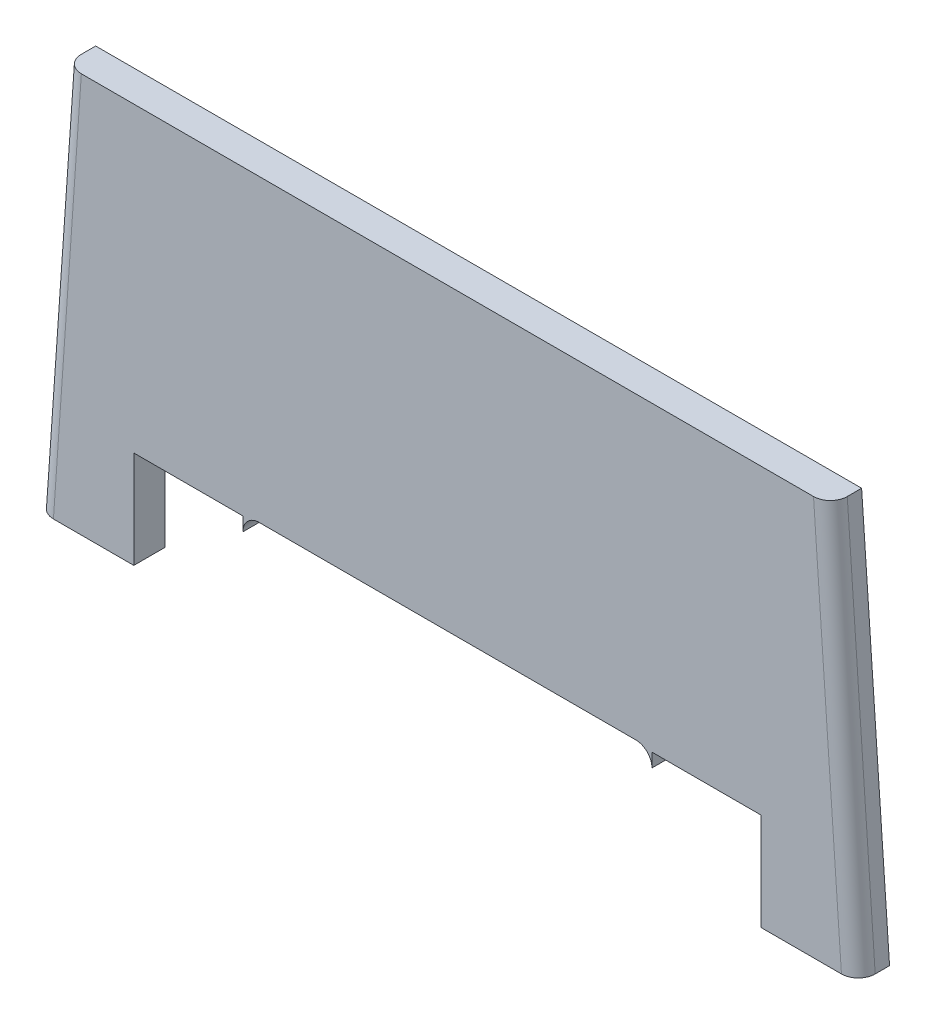
ISO-10303-21;
HEADER;
FILE_DESCRIPTION(('STEP AP214'),'2;1');
FILE_NAME('part.step','',(''),(''),'','','');
FILE_SCHEMA(('AUTOMOTIVE_DESIGN { 1 0 10303 214 1 1 1 1 }'));
ENDSEC;
DATA;
#1=APPLICATION_CONTEXT('core data for automotive mechanical design processes');
#2=APPLICATION_PROTOCOL_DEFINITION('international standard','automotive_design',2000,#1);
#3=PRODUCT_CONTEXT('',#1,'mechanical');
#4=PRODUCT('Part','Part','',(#3));
#5=PRODUCT_RELATED_PRODUCT_CATEGORY('part','',(#4));
#6=PRODUCT_DEFINITION_FORMATION('','',#4);
#7=PRODUCT_DEFINITION_CONTEXT('part definition',#1,'design');
#8=PRODUCT_DEFINITION('design','',#6,#7);
#9=PRODUCT_DEFINITION_SHAPE('','',#8);
#10=(LENGTH_UNIT() NAMED_UNIT(*) SI_UNIT(.MILLI.,.METRE.));
#11=(NAMED_UNIT(*) PLANE_ANGLE_UNIT() SI_UNIT($,.RADIAN.));
#12=(NAMED_UNIT(*) SI_UNIT($,.STERADIAN.) SOLID_ANGLE_UNIT());
#13=UNCERTAINTY_MEASURE_WITH_UNIT(LENGTH_MEASURE(1.E-05),#10,'distance_accuracy_value','');
#14=(GEOMETRIC_REPRESENTATION_CONTEXT(3) GLOBAL_UNCERTAINTY_ASSIGNED_CONTEXT((#13)) GLOBAL_UNIT_ASSIGNED_CONTEXT((#10,
#11,#12)) REPRESENTATION_CONTEXT('',''));
#15=CARTESIAN_POINT('',(0.,0.,0.));
#16=DIRECTION('',(0.,0.,1.));
#17=DIRECTION('',(1.,0.,0.));
#18=AXIS2_PLACEMENT_3D('',#15,#16,#17);
#19=CARTESIAN_POINT('',(-251.2,-80.,25.));
#20=DIRECTION('',(0.,-1.,0.));
#21=DIRECTION('',(1.,0.,0.));
#22=AXIS2_PLACEMENT_3D('',#19,#20,#21);
#23=PLANE('',#22);
#24=DIRECTION('',(-1.,0.,0.));
#25=VECTOR('',#24,1.);
#26=CARTESIAN_POINT('',(-251.2,-80.,25.));
#27=LINE('',#26,#25);
#28=CARTESIAN_POINT('',(-251.2,-80.,25.));
#29=VERTEX_POINT('',#28);
#30=CARTESIAN_POINT('',(-315.567034375904,-80.,25.));
#31=VERTEX_POINT('',#30);
#32=EDGE_CURVE('E180',#29,#31,#27,.T.);
#33=ORIENTED_EDGE('',*,*,#32,.T.);
#34=CARTESIAN_POINT('',(-315.567034375904,-80.,11.5));
#35=DIRECTION('',(0.,-1.,0.));
#36=DIRECTION('',(1.,0.,0.));
#37=AXIS2_PLACEMENT_3D('',#34,#35,#36);
#38=ELLIPSE('',#37,13.5329656240958,13.5);
#39=CARTESIAN_POINT('',(-329.1,-80.,11.5));
#40=VERTEX_POINT('',#39);
#41=EDGE_CURVE('E11',#31,#40,#38,.T.);
#42=ORIENTED_EDGE('',*,*,#41,.T.);
#43=DIRECTION('',(0.,0.,-1.));
#44=VECTOR('',#43,1.);
#45=CARTESIAN_POINT('',(-329.1,-80.,25.));
#46=LINE('',#45,#44);
#47=CARTESIAN_POINT('',(-329.1,-80.,0.));
#48=VERTEX_POINT('',#47);
#49=EDGE_CURVE('E203',#40,#48,#46,.T.);
#50=ORIENTED_EDGE('',*,*,#49,.T.);
#51=DIRECTION('',(-1.,0.,0.));
#52=VECTOR('',#51,1.);
#53=CARTESIAN_POINT('',(-251.2,-80.,0.));
#54=LINE('',#53,#52);
#55=CARTESIAN_POINT('',(-251.2,-80.,0.));
#56=VERTEX_POINT('',#55);
#57=EDGE_CURVE('E204',#56,#48,#54,.T.);
#58=ORIENTED_EDGE('',*,*,#57,.F.);
#59=DIRECTION('',(0.,0.,-1.));
#60=VECTOR('',#59,1.);
#61=CARTESIAN_POINT('',(-251.2,-80.,25.));
#62=LINE('',#61,#60);
#63=EDGE_CURVE('E240',#29,#56,#62,.T.);
#64=ORIENTED_EDGE('',*,*,#63,.F.);
#65=EDGE_LOOP('',(#33,#42,#50,#58,#64));
#66=FACE_BOUND('',#65,.T.);
#67=ADVANCED_FACE('F36',(#66),#23,.T.);
#68=CARTESIAN_POINT('',(-251.2,-2.,25.));
#69=DIRECTION('',(1.,0.,0.));
#70=DIRECTION('',(0.,0.,-1.));
#71=AXIS2_PLACEMENT_3D('',#68,#69,#70);
#72=PLANE('',#71);
#73=DIRECTION('',(0.,-1.,0.));
#74=VECTOR('',#73,1.);
#75=CARTESIAN_POINT('',(-251.2,-2.,0.));
#76=LINE('',#75,#74);
#77=CARTESIAN_POINT('',(-251.2,-2.,0.));
#78=VERTEX_POINT('',#77);
#79=EDGE_CURVE('E237',#78,#56,#76,.T.);
#80=ORIENTED_EDGE('',*,*,#79,.F.);
#81=DIRECTION('',(0.,0.,-1.));
#82=VECTOR('',#81,1.);
#83=CARTESIAN_POINT('',(-251.2,-2.,25.));
#84=LINE('',#83,#82);
#85=CARTESIAN_POINT('',(-251.2,-2.,25.));
#86=VERTEX_POINT('',#85);
#87=EDGE_CURVE('E243',#86,#78,#84,.T.);
#88=ORIENTED_EDGE('',*,*,#87,.F.);
#89=DIRECTION('',(0.,-1.,0.));
#90=VECTOR('',#89,1.);
#91=CARTESIAN_POINT('',(-251.2,-2.,25.));
#92=LINE('',#91,#90);
#93=EDGE_CURVE('E200',#86,#29,#92,.T.);
#94=ORIENTED_EDGE('',*,*,#93,.T.);
#95=ORIENTED_EDGE('',*,*,#63,.T.);
#96=EDGE_LOOP('',(#80,#88,#94,#95));
#97=FACE_BOUND('',#96,.T.);
#98=ADVANCED_FACE('F295',(#97),#72,.T.);
#99=CARTESIAN_POINT('',(-163.8,-1.99999999999999,25.));
#100=DIRECTION('',(0.,-1.,0.));
#101=DIRECTION('',(1.,0.,0.));
#102=AXIS2_PLACEMENT_3D('',#99,#100,#101);
#103=PLANE('',#102);
#104=DIRECTION('',(-1.,0.,0.));
#105=VECTOR('',#104,1.);
#106=CARTESIAN_POINT('',(-163.8,-1.99999999999999,0.));
#107=LINE('',#106,#105);
#108=CARTESIAN_POINT('',(-163.8,-1.99999999999999,0.));
#109=VERTEX_POINT('',#108);
#110=EDGE_CURVE('E234',#109,#78,#107,.T.);
#111=ORIENTED_EDGE('',*,*,#110,.F.);
#112=DIRECTION('',(0.,0.,-1.));
#113=VECTOR('',#112,1.);
#114=CARTESIAN_POINT('',(-163.8,-1.99999999999999,25.));
#115=LINE('',#114,#113);
#116=CARTESIAN_POINT('',(-163.8,-1.99999999999999,25.));
#117=VERTEX_POINT('',#116);
#118=EDGE_CURVE('E245',#117,#109,#115,.T.);
#119=ORIENTED_EDGE('',*,*,#118,.F.);
#120=DIRECTION('',(-1.,0.,0.));
#121=VECTOR('',#120,1.);
#122=CARTESIAN_POINT('',(-163.8,-1.99999999999999,25.));
#123=LINE('',#122,#121);
#124=EDGE_CURVE('E197',#117,#86,#123,.T.);
#125=ORIENTED_EDGE('',*,*,#124,.T.);
#126=ORIENTED_EDGE('',*,*,#87,.T.);
#127=EDGE_LOOP('',(#111,#119,#125,#126));
#128=FACE_BOUND('',#127,.T.);
#129=ADVANCED_FACE('F298',(#128),#103,.T.);
#130=CARTESIAN_POINT('',(-163.8,-1.99999999999999,25.));
#131=DIRECTION('',(1.,0.,0.));
#132=DIRECTION('',(0.,1.,0.));
#133=AXIS2_PLACEMENT_3D('',#130,#131,#132);
#134=PLANE('',#133);
#135=DIRECTION('',(0.,-1.,0.));
#136=VECTOR('',#135,1.);
#137=CARTESIAN_POINT('',(-163.8,-1.99999999999999,0.));
#138=LINE('',#137,#136);
#139=CARTESIAN_POINT('',(-163.8,-13.,0.));
#140=VERTEX_POINT('',#139);
#141=EDGE_CURVE('E232',#109,#140,#138,.T.);
#142=ORIENTED_EDGE('',*,*,#141,.T.);
#143=DIRECTION('',(0.,0.,-1.));
#144=VECTOR('',#143,1.);
#145=CARTESIAN_POINT('',(-163.8,-13.,25.));
#146=LINE('',#145,#144);
#147=CARTESIAN_POINT('',(-163.8,-13.,25.));
#148=VERTEX_POINT('',#147);
#149=EDGE_CURVE('E247',#148,#140,#146,.T.);
#150=ORIENTED_EDGE('',*,*,#149,.F.);
#151=DIRECTION('',(0.,-1.,0.));
#152=VECTOR('',#151,1.);
#153=CARTESIAN_POINT('',(-163.8,-1.99999999999999,25.));
#154=LINE('',#153,#152);
#155=EDGE_CURVE('E195',#117,#148,#154,.T.);
#156=ORIENTED_EDGE('',*,*,#155,.F.);
#157=ORIENTED_EDGE('',*,*,#118,.T.);
#158=EDGE_LOOP('',(#142,#150,#156,#157));
#159=FACE_BOUND('',#158,.T.);
#160=ADVANCED_FACE('F304',(#159),#134,.F.);
#161=CARTESIAN_POINT('',(-150.8,-13.,25.));
#162=DIRECTION('',(0.,0.,-1.));
#163=DIRECTION('',(-1.,0.,0.));
#164=AXIS2_PLACEMENT_3D('',#161,#162,#163);
#165=CYLINDRICAL_SURFACE('',#164,13.);
#166=CARTESIAN_POINT('',(-150.8,-13.,0.));
#167=DIRECTION('',(0.,0.,-1.));
#168=DIRECTION('',(-1.,0.,0.));
#169=AXIS2_PLACEMENT_3D('',#166,#167,#168);
#170=CIRCLE('',#169,13.);
#171=CARTESIAN_POINT('',(-150.8,0.,0.));
#172=VERTEX_POINT('',#171);
#173=EDGE_CURVE('E230',#140,#172,#170,.T.);
#174=ORIENTED_EDGE('',*,*,#173,.T.);
#175=DIRECTION('',(0.,0.,-1.));
#176=VECTOR('',#175,1.);
#177=CARTESIAN_POINT('',(-150.8,0.,25.));
#178=LINE('',#177,#176);
#179=CARTESIAN_POINT('',(-150.8,0.,25.));
#180=VERTEX_POINT('',#179);
#181=EDGE_CURVE('E250',#180,#172,#178,.T.);
#182=ORIENTED_EDGE('',*,*,#181,.F.);
#183=CARTESIAN_POINT('',(-150.8,-13.,25.));
#184=DIRECTION('',(0.,0.,-1.));
#185=DIRECTION('',(-1.,0.,0.));
#186=AXIS2_PLACEMENT_3D('',#183,#184,#185);
#187=CIRCLE('',#186,13.);
#188=EDGE_CURVE('E193',#148,#180,#187,.T.);
#189=ORIENTED_EDGE('',*,*,#188,.F.);
#190=ORIENTED_EDGE('',*,*,#149,.T.);
#191=EDGE_LOOP('',(#174,#182,#189,#190));
#192=FACE_BOUND('',#191,.T.);
#193=ADVANCED_FACE('F308',(#192),#165,.F.);
#194=CARTESIAN_POINT('',(-150.8,0.,25.));
#195=DIRECTION('',(0.,1.,0.));
#196=DIRECTION('',(-1.,0.,0.));
#197=AXIS2_PLACEMENT_3D('',#194,#195,#196);
#198=PLANE('',#197);
#199=DIRECTION('',(1.,0.,0.));
#200=VECTOR('',#199,1.);
#201=CARTESIAN_POINT('',(-150.8,0.,0.));
#202=LINE('',#201,#200);
#203=CARTESIAN_POINT('',(150.8,0.,0.));
#204=VERTEX_POINT('',#203);
#205=EDGE_CURVE('E227',#172,#204,#202,.T.);
#206=ORIENTED_EDGE('',*,*,#205,.T.);
#207=DIRECTION('',(0.,0.,-1.));
#208=VECTOR('',#207,1.);
#209=CARTESIAN_POINT('',(150.8,0.,25.));
#210=LINE('',#209,#208);
#211=CARTESIAN_POINT('',(150.8,0.,25.));
#212=VERTEX_POINT('',#211);
#213=EDGE_CURVE('E253',#212,#204,#210,.T.);
#214=ORIENTED_EDGE('',*,*,#213,.F.);
#215=DIRECTION('',(1.,0.,0.));
#216=VECTOR('',#215,1.);
#217=CARTESIAN_POINT('',(-150.8,0.,25.));
#218=LINE('',#217,#216);
#219=EDGE_CURVE('E191',#180,#212,#218,.T.);
#220=ORIENTED_EDGE('',*,*,#219,.F.);
#221=ORIENTED_EDGE('',*,*,#181,.T.);
#222=EDGE_LOOP('',(#206,#214,#220,#221));
#223=FACE_BOUND('',#222,.T.);
#224=ADVANCED_FACE('F313',(#223),#198,.F.);
#225=CARTESIAN_POINT('',(150.8,-13.,25.));
#226=DIRECTION('',(0.,0.,-1.));
#227=DIRECTION('',(-1.,0.,0.));
#228=AXIS2_PLACEMENT_3D('',#225,#226,#227);
#229=CYLINDRICAL_SURFACE('',#228,13.);
#230=CARTESIAN_POINT('',(150.8,-13.,0.));
#231=DIRECTION('',(0.,0.,1.));
#232=DIRECTION('',(1.,0.,0.));
#233=AXIS2_PLACEMENT_3D('',#230,#231,#232);
#234=CIRCLE('',#233,13.);
#235=CARTESIAN_POINT('',(163.8,-13.,0.));
#236=VERTEX_POINT('',#235);
#237=EDGE_CURVE('E224',#236,#204,#234,.T.);
#238=ORIENTED_EDGE('',*,*,#237,.F.);
#239=DIRECTION('',(0.,0.,-1.));
#240=VECTOR('',#239,1.);
#241=CARTESIAN_POINT('',(163.8,-13.,25.));
#242=LINE('',#241,#240);
#243=CARTESIAN_POINT('',(163.8,-13.,25.));
#244=VERTEX_POINT('',#243);
#245=EDGE_CURVE('E255',#244,#236,#242,.T.);
#246=ORIENTED_EDGE('',*,*,#245,.F.);
#247=CARTESIAN_POINT('',(150.8,-13.,25.));
#248=DIRECTION('',(0.,0.,1.));
#249=DIRECTION('',(1.,0.,0.));
#250=AXIS2_PLACEMENT_3D('',#247,#248,#249);
#251=CIRCLE('',#250,13.);
#252=EDGE_CURVE('E188',#244,#212,#251,.T.);
#253=ORIENTED_EDGE('',*,*,#252,.T.);
#254=ORIENTED_EDGE('',*,*,#213,.T.);
#255=EDGE_LOOP('',(#238,#246,#253,#254));
#256=FACE_BOUND('',#255,.T.);
#257=ADVANCED_FACE('F360',(#256),#229,.F.);
#258=CARTESIAN_POINT('',(163.8,-1.99999999999995,25.));
#259=DIRECTION('',(1.,0.,0.));
#260=DIRECTION('',(0.,1.,0.));
#261=AXIS2_PLACEMENT_3D('',#258,#259,#260);
#262=PLANE('',#261);
#263=DIRECTION('',(0.,-1.,0.));
#264=VECTOR('',#263,1.);
#265=CARTESIAN_POINT('',(163.8,-1.99999999999995,0.));
#266=LINE('',#265,#264);
#267=CARTESIAN_POINT('',(163.8,-1.99999999999995,0.));
#268=VERTEX_POINT('',#267);
#269=EDGE_CURVE('E221',#268,#236,#266,.T.);
#270=ORIENTED_EDGE('',*,*,#269,.F.);
#271=DIRECTION('',(0.,0.,-1.));
#272=VECTOR('',#271,1.);
#273=CARTESIAN_POINT('',(163.8,-1.99999999999995,25.));
#274=LINE('',#273,#272);
#275=CARTESIAN_POINT('',(163.8,-1.99999999999995,25.));
#276=VERTEX_POINT('',#275);
#277=EDGE_CURVE('E257',#276,#268,#274,.T.);
#278=ORIENTED_EDGE('',*,*,#277,.F.);
#279=DIRECTION('',(0.,-1.,0.));
#280=VECTOR('',#279,1.);
#281=CARTESIAN_POINT('',(163.8,-1.99999999999995,25.));
#282=LINE('',#281,#280);
#283=EDGE_CURVE('E185',#276,#244,#282,.T.);
#284=ORIENTED_EDGE('',*,*,#283,.T.);
#285=ORIENTED_EDGE('',*,*,#245,.T.);
#286=EDGE_LOOP('',(#270,#278,#284,#285));
#287=FACE_BOUND('',#286,.T.);
#288=ADVANCED_FACE('F318',(#287),#262,.T.);
#289=CARTESIAN_POINT('',(163.8,-1.99999999999995,25.));
#290=DIRECTION('',(0.,1.,0.));
#291=DIRECTION('',(-1.,0.,0.));
#292=AXIS2_PLACEMENT_3D('',#289,#290,#291);
#293=PLANE('',#292);
#294=DIRECTION('',(1.,0.,0.));
#295=VECTOR('',#294,1.);
#296=CARTESIAN_POINT('',(163.8,-1.99999999999995,0.));
#297=LINE('',#296,#295);
#298=CARTESIAN_POINT('',(251.2,-1.99999999999994,0.));
#299=VERTEX_POINT('',#298);
#300=EDGE_CURVE('E219',#268,#299,#297,.T.);
#301=ORIENTED_EDGE('',*,*,#300,.T.);
#302=DIRECTION('',(0.,0.,-1.));
#303=VECTOR('',#302,1.);
#304=CARTESIAN_POINT('',(251.2,-1.99999999999994,25.));
#305=LINE('',#304,#303);
#306=CARTESIAN_POINT('',(251.2,-1.99999999999994,25.));
#307=VERTEX_POINT('',#306);
#308=EDGE_CURVE('E171',#307,#299,#305,.T.);
#309=ORIENTED_EDGE('',*,*,#308,.F.);
#310=DIRECTION('',(1.,0.,0.));
#311=VECTOR('',#310,1.);
#312=CARTESIAN_POINT('',(163.8,-1.99999999999995,25.));
#313=LINE('',#312,#311);
#314=EDGE_CURVE('E158',#276,#307,#313,.T.);
#315=ORIENTED_EDGE('',*,*,#314,.F.);
#316=ORIENTED_EDGE('',*,*,#277,.T.);
#317=EDGE_LOOP('',(#301,#309,#315,#316));
#318=FACE_BOUND('',#317,.T.);
#319=ADVANCED_FACE('F322',(#318),#293,.F.);
#320=CARTESIAN_POINT('',(251.2,-1.99999999999994,25.));
#321=DIRECTION('',(1.,0.,0.));
#322=DIRECTION('',(0.,1.,0.));
#323=AXIS2_PLACEMENT_3D('',#320,#321,#322);
#324=PLANE('',#323);
#325=DIRECTION('',(0.,-1.,0.));
#326=VECTOR('',#325,1.);
#327=CARTESIAN_POINT('',(251.2,-1.99999999999994,0.));
#328=LINE('',#327,#326);
#329=CARTESIAN_POINT('',(251.2,-79.9999999999999,0.));
#330=VERTEX_POINT('',#329);
#331=EDGE_CURVE('E167',#299,#330,#328,.T.);
#332=ORIENTED_EDGE('',*,*,#331,.T.);
#333=DIRECTION('',(0.,0.,-1.));
#334=VECTOR('',#333,1.);
#335=CARTESIAN_POINT('',(251.2,-79.9999999999999,25.));
#336=LINE('',#335,#334);
#337=CARTESIAN_POINT('',(251.2,-79.9999999999999,25.));
#338=VERTEX_POINT('',#337);
#339=EDGE_CURVE('E164',#338,#330,#336,.T.);
#340=ORIENTED_EDGE('',*,*,#339,.F.);
#341=DIRECTION('',(0.,-1.,0.));
#342=VECTOR('',#341,1.);
#343=CARTESIAN_POINT('',(251.2,-1.99999999999994,25.));
#344=LINE('',#343,#342);
#345=EDGE_CURVE('E149',#307,#338,#344,.T.);
#346=ORIENTED_EDGE('',*,*,#345,.F.);
#347=ORIENTED_EDGE('',*,*,#308,.T.);
#348=EDGE_LOOP('',(#332,#340,#346,#347));
#349=FACE_BOUND('',#348,.T.);
#350=ADVANCED_FACE('F165',(#349),#324,.F.);
#351=CARTESIAN_POINT('',(251.2,-79.9999999999999,25.));
#352=DIRECTION('',(0.,1.,0.));
#353=DIRECTION('',(-1.,0.,0.));
#354=AXIS2_PLACEMENT_3D('',#351,#352,#353);
#355=PLANE('',#354);
#356=DIRECTION('',(0.,0.,-1.));
#357=VECTOR('',#356,1.);
#358=CARTESIAN_POINT('',(329.1,-79.9999999999999,25.));
#359=LINE('',#358,#357);
#360=CARTESIAN_POINT('',(329.1,-79.9999999999999,11.5));
#361=VERTEX_POINT('',#360);
#362=CARTESIAN_POINT('',(329.1,-79.9999999999999,0.));
#363=VERTEX_POINT('',#362);
#364=EDGE_CURVE('E172',#361,#363,#359,.T.);
#365=ORIENTED_EDGE('',*,*,#364,.F.);
#366=CARTESIAN_POINT('',(315.567034375904,-79.9999999999999,11.5));
#367=DIRECTION('',(0.,1.,0.));
#368=DIRECTION('',(1.,0.,0.));
#369=AXIS2_PLACEMENT_3D('',#366,#367,#368);
#370=ELLIPSE('',#369,13.5329656240958,13.5);
#371=CARTESIAN_POINT('',(315.567034375904,-79.9999999999999,25.));
#372=VERTEX_POINT('',#371);
#373=EDGE_CURVE('E176',#361,#372,#370,.F.);
#374=ORIENTED_EDGE('',*,*,#373,.T.);
#375=DIRECTION('',(1.,0.,0.));
#376=VECTOR('',#375,1.);
#377=CARTESIAN_POINT('',(251.2,-79.9999999999999,25.));
#378=LINE('',#377,#376);
#379=EDGE_CURVE('E154',#338,#372,#378,.T.);
#380=ORIENTED_EDGE('',*,*,#379,.F.);
#381=ORIENTED_EDGE('',*,*,#339,.T.);
#382=DIRECTION('',(1.,0.,0.));
#383=VECTOR('',#382,1.);
#384=CARTESIAN_POINT('',(251.2,-79.9999999999999,0.));
#385=LINE('',#384,#383);
#386=EDGE_CURVE('E216',#330,#363,#385,.T.);
#387=ORIENTED_EDGE('',*,*,#386,.T.);
#388=EDGE_LOOP('',(#365,#374,#380,#381,#387));
#389=FACE_BOUND('',#388,.T.);
#390=ADVANCED_FACE('F174',(#389),#355,.F.);
#391=CARTESIAN_POINT('',(329.1,-79.9999999999999,25.));
#392=DIRECTION('',(-0.997564050259824,-0.069756473744129,0.));
#393=DIRECTION('',(0.069756473744129,-0.997564050259824,0.));
#394=AXIS2_PLACEMENT_3D('',#391,#392,#393);
#395=PLANE('',#394);
#396=DIRECTION('',(0.,0.,-1.));
#397=VECTOR('',#396,1.);
#398=CARTESIAN_POINT('',(306.723420178076,240.,25.));
#399=LINE('',#398,#397);
#400=CARTESIAN_POINT('',(306.723420178076,240.,11.5));
#401=VERTEX_POINT('',#400);
#402=CARTESIAN_POINT('',(306.723420178076,240.,0.));
#403=VERTEX_POINT('',#402);
#404=EDGE_CURVE('E261',#401,#403,#399,.T.);
#405=ORIENTED_EDGE('',*,*,#404,.F.);
#406=DIRECTION('',(-0.069756473744129,0.997564050259824,0.));
#407=VECTOR('',#406,1.);
#408=CARTESIAN_POINT('',(329.1,-79.9999999999999,11.5));
#409=LINE('',#408,#407);
#410=EDGE_CURVE('E57',#401,#361,#409,.F.);
#411=ORIENTED_EDGE('',*,*,#410,.T.);
#412=ORIENTED_EDGE('',*,*,#364,.T.);
#413=DIRECTION('',(-0.069756473744129,0.997564050259824,0.));
#414=VECTOR('',#413,1.);
#415=CARTESIAN_POINT('',(329.1,-79.9999999999999,0.));
#416=LINE('',#415,#414);
#417=EDGE_CURVE('E213',#363,#403,#416,.T.);
#418=ORIENTED_EDGE('',*,*,#417,.T.);
#419=EDGE_LOOP('',(#405,#411,#412,#418));
#420=FACE_BOUND('',#419,.T.);
#421=ADVANCED_FACE('F325',(#420),#395,.F.);
#422=CARTESIAN_POINT('',(-306.723420178076,240.,25.));
#423=DIRECTION('',(0.,1.,0.));
#424=DIRECTION('',(-1.,0.,0.));
#425=AXIS2_PLACEMENT_3D('',#422,#423,#424);
#426=PLANE('',#425);
#427=DIRECTION('',(1.,0.,0.));
#428=VECTOR('',#427,1.);
#429=CARTESIAN_POINT('',(-306.723420178076,240.,25.));
#430=LINE('',#429,#428);
#431=CARTESIAN_POINT('',(-293.19045455398,240.,25.));
#432=VERTEX_POINT('',#431);
#433=CARTESIAN_POINT('',(293.19045455398,240.,25.));
#434=VERTEX_POINT('',#433);
#435=EDGE_CURVE('E177',#432,#434,#430,.T.);
#436=ORIENTED_EDGE('',*,*,#435,.T.);
#437=CARTESIAN_POINT('',(293.19045455398,240.,11.5));
#438=DIRECTION('',(0.,1.,0.));
#439=DIRECTION('',(1.,0.,0.));
#440=AXIS2_PLACEMENT_3D('',#437,#438,#439);
#441=ELLIPSE('',#440,13.5329656240958,13.5);
#442=EDGE_CURVE('E271',#434,#401,#441,.T.);
#443=ORIENTED_EDGE('',*,*,#442,.T.);
#444=ORIENTED_EDGE('',*,*,#404,.T.);
#445=DIRECTION('',(1.,0.,0.));
#446=VECTOR('',#445,1.);
#447=CARTESIAN_POINT('',(-306.723420178076,240.,0.));
#448=LINE('',#447,#446);
#449=CARTESIAN_POINT('',(-306.723420178076,240.,0.));
#450=VERTEX_POINT('',#449);
#451=EDGE_CURVE('E210',#450,#403,#448,.T.);
#452=ORIENTED_EDGE('',*,*,#451,.F.);
#453=DIRECTION('',(0.,0.,-1.));
#454=VECTOR('',#453,1.);
#455=CARTESIAN_POINT('',(-306.723420178076,240.,25.));
#456=LINE('',#455,#454);
#457=CARTESIAN_POINT('',(-306.723420178076,240.,11.5));
#458=VERTEX_POINT('',#457);
#459=EDGE_CURVE('E263',#458,#450,#456,.T.);
#460=ORIENTED_EDGE('',*,*,#459,.F.);
#461=CARTESIAN_POINT('',(-293.19045455398,240.,11.5));
#462=DIRECTION('',(0.,1.,0.));
#463=DIRECTION('',(1.,0.,0.));
#464=AXIS2_PLACEMENT_3D('',#461,#462,#463);
#465=ELLIPSE('',#464,13.5329656240958,13.5);
#466=EDGE_CURVE('E269',#458,#432,#465,.T.);
#467=ORIENTED_EDGE('',*,*,#466,.T.);
#468=EDGE_LOOP('',(#436,#443,#444,#452,#460,#467));
#469=FACE_BOUND('',#468,.T.);
#470=ADVANCED_FACE('F283',(#469),#426,.T.);
#471=CARTESIAN_POINT('',(-329.1,-80.,25.));
#472=DIRECTION('',(-0.997564050259824,0.0697564737441287,0.));
#473=DIRECTION('',(-0.0697564737441287,-0.997564050259824,0.));
#474=AXIS2_PLACEMENT_3D('',#471,#472,#473);
#475=PLANE('',#474);
#476=ORIENTED_EDGE('',*,*,#49,.F.);
#477=DIRECTION('',(0.0697564737441287,0.997564050259824,0.));
#478=VECTOR('',#477,1.);
#479=CARTESIAN_POINT('',(-329.1,-80.,11.5));
#480=LINE('',#479,#478);
#481=EDGE_CURVE('E44',#40,#458,#480,.T.);
#482=ORIENTED_EDGE('',*,*,#481,.T.);
#483=ORIENTED_EDGE('',*,*,#459,.T.);
#484=DIRECTION('',(0.0697564737441287,0.997564050259824,0.));
#485=VECTOR('',#484,1.);
#486=CARTESIAN_POINT('',(-329.1,-80.,0.));
#487=LINE('',#486,#485);
#488=EDGE_CURVE('E207',#48,#450,#487,.T.);
#489=ORIENTED_EDGE('',*,*,#488,.F.);
#490=EDGE_LOOP('',(#476,#482,#483,#489));
#491=FACE_BOUND('',#490,.T.);
#492=ADVANCED_FACE('F278',(#491),#475,.T.);
#493=CARTESIAN_POINT('',(150.8,-13.,25.));
#494=DIRECTION('',(0.,0.,1.));
#495=DIRECTION('',(1.,0.,0.));
#496=AXIS2_PLACEMENT_3D('',#493,#494,#495);
#497=PLANE('',#496);
#498=ORIENTED_EDGE('',*,*,#379,.T.);
#499=DIRECTION('',(-0.069756473744129,0.997564050259824,0.));
#500=VECTOR('',#499,1.);
#501=CARTESIAN_POINT('',(293.256305499568,239.058287604454,25.));
#502=LINE('',#501,#500);
#503=EDGE_CURVE('E267',#372,#434,#502,.T.);
#504=ORIENTED_EDGE('',*,*,#503,.T.);
#505=ORIENTED_EDGE('',*,*,#435,.F.);
#506=DIRECTION('',(0.0697564737441287,0.997564050259824,0.));
#507=VECTOR('',#506,1.);
#508=CARTESIAN_POINT('',(-308.635409533869,19.1268534826662,25.));
#509=LINE('',#508,#507);
#510=EDGE_CURVE('E242',#432,#31,#509,.F.);
#511=ORIENTED_EDGE('',*,*,#510,.T.);
#512=ORIENTED_EDGE('',*,*,#32,.F.);
#513=ORIENTED_EDGE('',*,*,#93,.F.);
#514=ORIENTED_EDGE('',*,*,#124,.F.);
#515=ORIENTED_EDGE('',*,*,#155,.T.);
#516=ORIENTED_EDGE('',*,*,#188,.T.);
#517=ORIENTED_EDGE('',*,*,#219,.T.);
#518=ORIENTED_EDGE('',*,*,#252,.F.);
#519=ORIENTED_EDGE('',*,*,#283,.F.);
#520=ORIENTED_EDGE('',*,*,#314,.T.);
#521=ORIENTED_EDGE('',*,*,#345,.T.);
#522=EDGE_LOOP('',(#498,#504,#505,#511,#512,#513,#514,#515,#516,#517,#518,#519,#520,#521));
#523=FACE_BOUND('',#522,.T.);
#524=ADVANCED_FACE('F151',(#523),#497,.T.);
#525=CARTESIAN_POINT('',(150.8,-13.,0.));
#526=DIRECTION('',(0.,0.,1.));
#527=DIRECTION('',(1.,0.,0.));
#528=AXIS2_PLACEMENT_3D('',#525,#526,#527);
#529=PLANE('',#528);
#530=ORIENTED_EDGE('',*,*,#57,.T.);
#531=ORIENTED_EDGE('',*,*,#488,.T.);
#532=ORIENTED_EDGE('',*,*,#451,.T.);
#533=ORIENTED_EDGE('',*,*,#417,.F.);
#534=ORIENTED_EDGE('',*,*,#386,.F.);
#535=ORIENTED_EDGE('',*,*,#331,.F.);
#536=ORIENTED_EDGE('',*,*,#300,.F.);
#537=ORIENTED_EDGE('',*,*,#269,.T.);
#538=ORIENTED_EDGE('',*,*,#237,.T.);
#539=ORIENTED_EDGE('',*,*,#205,.F.);
#540=ORIENTED_EDGE('',*,*,#173,.F.);
#541=ORIENTED_EDGE('',*,*,#141,.F.);
#542=ORIENTED_EDGE('',*,*,#110,.T.);
#543=ORIENTED_EDGE('',*,*,#79,.T.);
#544=EDGE_LOOP('',(#530,#531,#532,#533,#534,#535,#536,#537,#538,#539,#540,#541,#542,#543));
#545=FACE_BOUND('',#544,.T.);
#546=ADVANCED_FACE('F287',(#545),#529,.F.);
#547=CARTESIAN_POINT('',(310.102984767641,-1.86045014211264,11.5));
#548=DIRECTION('',(0.069756473744129,-0.997564050259824,0.));
#549=DIRECTION('',(0.997564050259824,0.069756473744129,0.));
#550=AXIS2_PLACEMENT_3D('',#547,#548,#549);
#551=CYLINDRICAL_SURFACE('',#550,13.5);
#552=ORIENTED_EDGE('',*,*,#373,.F.);
#553=ORIENTED_EDGE('',*,*,#410,.F.);
#554=ORIENTED_EDGE('',*,*,#442,.F.);
#555=ORIENTED_EDGE('',*,*,#503,.F.);
#556=EDGE_LOOP('',(#552,#553,#554,#555));
#557=FACE_BOUND('',#556,.T.);
#558=ADVANCED_FACE('F324',(#557),#551,.T.);
#559=CARTESIAN_POINT('',(-315.632885321492,-80.9417123955457,11.5));
#560=DIRECTION('',(0.0697564737441287,0.997564050259824,0.));
#561=DIRECTION('',(-0.997564050259824,0.0697564737441287,0.));
#562=AXIS2_PLACEMENT_3D('',#559,#560,#561);
#563=CYLINDRICAL_SURFACE('',#562,13.5);
#564=ORIENTED_EDGE('',*,*,#41,.F.);
#565=ORIENTED_EDGE('',*,*,#510,.F.);
#566=ORIENTED_EDGE('',*,*,#466,.F.);
#567=ORIENTED_EDGE('',*,*,#481,.F.);
#568=EDGE_LOOP('',(#564,#565,#566,#567));
#569=FACE_BOUND('',#568,.T.);
#570=ADVANCED_FACE('F38',(#569),#563,.T.);
#571=CLOSED_SHELL('',(#67,#98,#129,#160,#193,#224,#257,#288,#319,#350,#390,#421,#470,#492,#524,
#546,#558,#570));
#572=MANIFOLD_SOLID_BREP('B2',#571);
#573=ADVANCED_BREP_SHAPE_REPRESENTATION('',(#18,#572),#14);
#574=SHAPE_DEFINITION_REPRESENTATION(#9,#573);
ENDSEC;
END-ISO-10303-21;
